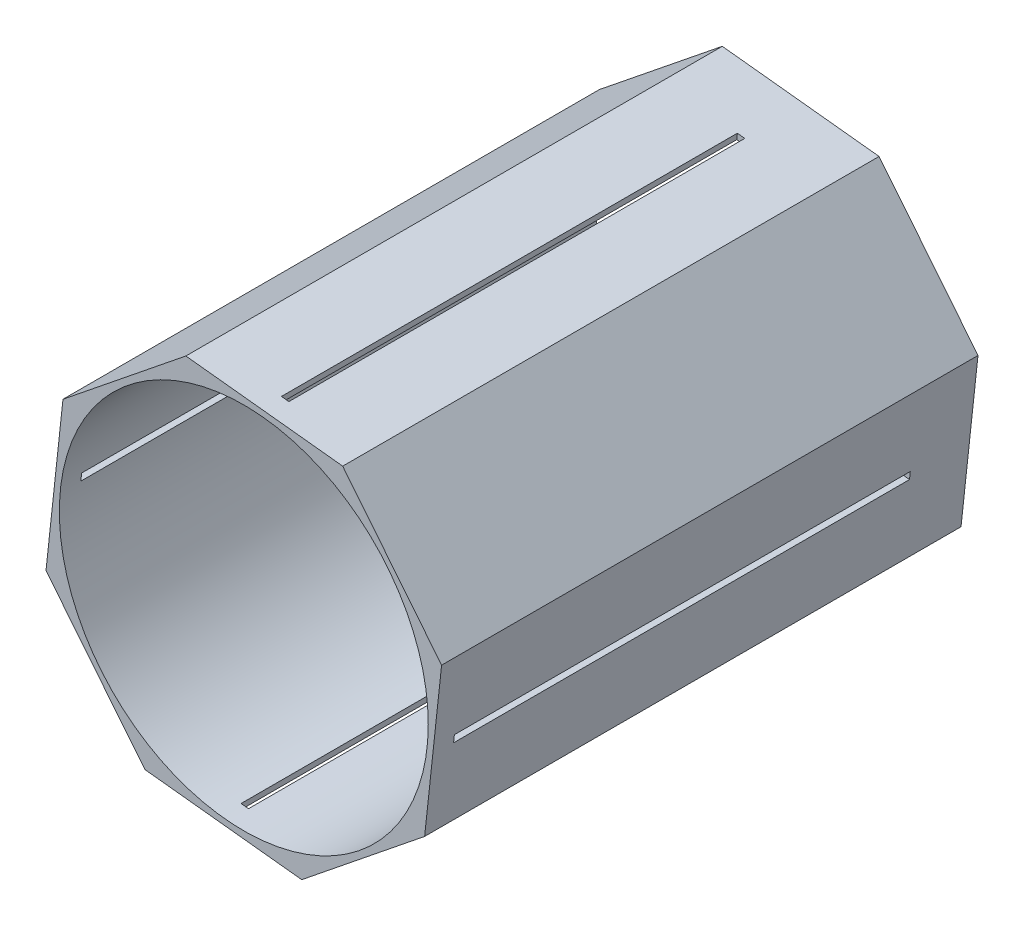
ISO-10303-21;
HEADER;
FILE_DESCRIPTION(('STEP AP214'),'2;1');
FILE_NAME('part.step','',(''),(''),'','','');
FILE_SCHEMA(('AUTOMOTIVE_DESIGN { 1 0 10303 214 1 1 1 1 }'));
ENDSEC;
DATA;
#1=APPLICATION_CONTEXT('core data for automotive mechanical design processes');
#2=APPLICATION_PROTOCOL_DEFINITION('international standard','automotive_design',2000,#1);
#3=PRODUCT_CONTEXT('',#1,'mechanical');
#4=PRODUCT('Part','Part','',(#3));
#5=PRODUCT_RELATED_PRODUCT_CATEGORY('part','',(#4));
#6=PRODUCT_DEFINITION_FORMATION('','',#4);
#7=PRODUCT_DEFINITION_CONTEXT('part definition',#1,'design');
#8=PRODUCT_DEFINITION('design','',#6,#7);
#9=PRODUCT_DEFINITION_SHAPE('','',#8);
#10=(LENGTH_UNIT() NAMED_UNIT(*) SI_UNIT(.MILLI.,.METRE.));
#11=(NAMED_UNIT(*) PLANE_ANGLE_UNIT() SI_UNIT($,.RADIAN.));
#12=(NAMED_UNIT(*) SI_UNIT($,.STERADIAN.) SOLID_ANGLE_UNIT());
#13=UNCERTAINTY_MEASURE_WITH_UNIT(LENGTH_MEASURE(1.E-05),#10,'distance_accuracy_value','');
#14=(GEOMETRIC_REPRESENTATION_CONTEXT(3) GLOBAL_UNCERTAINTY_ASSIGNED_CONTEXT((#13)) GLOBAL_UNIT_ASSIGNED_CONTEXT((#10,
#11,#12)) REPRESENTATION_CONTEXT('',''));
#15=CARTESIAN_POINT('',(0.,0.,0.));
#16=DIRECTION('',(0.,0.,1.));
#17=DIRECTION('',(1.,0.,0.));
#18=AXIS2_PLACEMENT_3D('',#15,#16,#17);
#19=CARTESIAN_POINT('',(0.,0.,228.6));
#20=DIRECTION('',(0.,0.,1.));
#21=DIRECTION('',(1.,0.,0.));
#22=AXIS2_PLACEMENT_3D('',#19,#20,#21);
#23=PLANE('',#22);
#24=DIRECTION('',(-0.626948126265606,0.779061003370112,0.));
#25=VECTOR('',#24,1.);
#26=CARTESIAN_POINT('',(84.2977940013584,24.6908402384421,228.6));
#27=LINE('',#26,#25);
#28=CARTESIAN_POINT('',(84.2977940013584,24.6908402384421,228.6));
#29=VERTEX_POINT('',#28);
#30=CARTESIAN_POINT('',(42.1484812116311,77.0666023432233,228.6));
#31=VERTEX_POINT('',#30);
#32=EDGE_CURVE('E290',#29,#31,#27,.T.);
#33=ORIENTED_EDGE('',*,*,#32,.T.);
#34=DIRECTION('',(-0.994198589975612,0.107560046906393,0.));
#35=VECTOR('',#34,1.);
#36=CARTESIAN_POINT('',(42.1484812116311,77.0666023432233,228.6));
#37=LINE('',#36,#35);
#38=CARTESIAN_POINT('',(-24.6908402384421,84.2977940013584,228.6));
#39=VERTEX_POINT('',#38);
#40=EDGE_CURVE('E293',#31,#39,#37,.T.);
#41=ORIENTED_EDGE('',*,*,#40,.T.);
#42=DIRECTION('',(-0.779061003370113,-0.626948126265606,0.));
#43=VECTOR('',#42,1.);
#44=CARTESIAN_POINT('',(-24.6908402384421,84.2977940013584,228.6));
#45=LINE('',#44,#43);
#46=CARTESIAN_POINT('',(-77.0666023432233,42.1484812116311,228.6));
#47=VERTEX_POINT('',#46);
#48=EDGE_CURVE('E296',#39,#47,#45,.T.);
#49=ORIENTED_EDGE('',*,*,#48,.T.);
#50=DIRECTION('',(-0.107560046906393,-0.994198589975612,0.));
#51=VECTOR('',#50,1.);
#52=CARTESIAN_POINT('',(-77.0666023432233,42.1484812116311,228.6));
#53=LINE('',#52,#51);
#54=CARTESIAN_POINT('',(-84.2977940013584,-24.6908402384421,228.6));
#55=VERTEX_POINT('',#54);
#56=EDGE_CURVE('E298',#47,#55,#53,.T.);
#57=ORIENTED_EDGE('',*,*,#56,.T.);
#58=DIRECTION('',(0.626948126265605,-0.779061003370112,0.));
#59=VECTOR('',#58,1.);
#60=CARTESIAN_POINT('',(-84.2977940013584,-24.6908402384421,228.6));
#61=LINE('',#60,#59);
#62=CARTESIAN_POINT('',(-42.148481211631,-77.0666023432233,228.6));
#63=VERTEX_POINT('',#62);
#64=EDGE_CURVE('E300',#55,#63,#61,.T.);
#65=ORIENTED_EDGE('',*,*,#64,.T.);
#66=DIRECTION('',(0.994198589975612,-0.107560046906393,0.));
#67=VECTOR('',#66,1.);
#68=CARTESIAN_POINT('',(-42.148481211631,-77.0666023432233,228.6));
#69=LINE('',#68,#67);
#70=CARTESIAN_POINT('',(24.6908402384421,-84.2977940013584,228.6));
#71=VERTEX_POINT('',#70);
#72=EDGE_CURVE('E302',#63,#71,#69,.T.);
#73=ORIENTED_EDGE('',*,*,#72,.T.);
#74=DIRECTION('',(0.779061003370113,0.626948126265605,0.));
#75=VECTOR('',#74,1.);
#76=CARTESIAN_POINT('',(24.6908402384421,-84.2977940013584,228.6));
#77=LINE('',#76,#75);
#78=CARTESIAN_POINT('',(77.0666023432233,-42.1484812116311,228.6));
#79=VERTEX_POINT('',#78);
#80=EDGE_CURVE('E304',#71,#79,#77,.T.);
#81=ORIENTED_EDGE('',*,*,#80,.T.);
#82=DIRECTION('',(0.107560046906393,0.994198589975612,0.));
#83=VECTOR('',#82,1.);
#84=CARTESIAN_POINT('',(77.0666023432233,-42.1484812116311,228.6));
#85=LINE('',#84,#83);
#86=EDGE_CURVE('E306',#79,#29,#85,.T.);
#87=ORIENTED_EDGE('',*,*,#86,.T.);
#88=EDGE_LOOP('',(#33,#41,#49,#57,#65,#73,#81,#87));
#89=FACE_BOUND('',#88,.T.);
#90=CARTESIAN_POINT('',(0.,0.,228.6));
#91=DIRECTION('',(0.,0.,1.));
#92=DIRECTION('',(1.,0.,0.));
#93=AXIS2_PLACEMENT_3D('',#90,#91,#92);
#94=CIRCLE('',#93,78.613);
#95=CARTESIAN_POINT('',(78.613,0.,228.6));
#96=VERTEX_POINT('',#95);
#97=EDGE_CURVE('E284',#96,#96,#94,.T.);
#98=ORIENTED_EDGE('',*,*,#97,.F.);
#99=EDGE_LOOP('',(#98));
#100=FACE_BOUND('',#99,.T.);
#101=ADVANCED_FACE('F37',(#89,#100),#23,.T.);
#102=CARTESIAN_POINT('',(0.,0.,0.));
#103=DIRECTION('',(0.,0.,1.));
#104=DIRECTION('',(1.,0.,0.));
#105=AXIS2_PLACEMENT_3D('',#102,#103,#104);
#106=PLANE('',#105);
#107=DIRECTION('',(-0.626948126265606,0.779061003370112,0.));
#108=VECTOR('',#107,1.);
#109=CARTESIAN_POINT('',(84.2977940013584,24.6908402384421,0.));
#110=LINE('',#109,#108);
#111=CARTESIAN_POINT('',(84.2977940013584,24.6908402384421,0.));
#112=VERTEX_POINT('',#111);
#113=CARTESIAN_POINT('',(42.1484812116311,77.0666023432233,0.));
#114=VERTEX_POINT('',#113);
#115=EDGE_CURVE('E287',#112,#114,#110,.T.);
#116=ORIENTED_EDGE('',*,*,#115,.F.);
#117=DIRECTION('',(0.107560046906393,0.994198589975612,0.));
#118=VECTOR('',#117,1.);
#119=CARTESIAN_POINT('',(77.0666023432233,-42.1484812116311,0.));
#120=LINE('',#119,#118);
#121=CARTESIAN_POINT('',(77.0666023432233,-42.1484812116311,0.));
#122=VERTEX_POINT('',#121);
#123=EDGE_CURVE('E294',#122,#112,#120,.T.);
#124=ORIENTED_EDGE('',*,*,#123,.F.);
#125=DIRECTION('',(0.779061003370113,0.626948126265605,0.));
#126=VECTOR('',#125,1.);
#127=CARTESIAN_POINT('',(24.6908402384421,-84.2977940013584,0.));
#128=LINE('',#127,#126);
#129=CARTESIAN_POINT('',(24.6908402384421,-84.2977940013584,0.));
#130=VERTEX_POINT('',#129);
#131=EDGE_CURVE('E321',#130,#122,#128,.T.);
#132=ORIENTED_EDGE('',*,*,#131,.F.);
#133=DIRECTION('',(0.994198589975612,-0.107560046906393,0.));
#134=VECTOR('',#133,1.);
#135=CARTESIAN_POINT('',(-42.148481211631,-77.0666023432233,0.));
#136=LINE('',#135,#134);
#137=CARTESIAN_POINT('',(-42.148481211631,-77.0666023432233,0.));
#138=VERTEX_POINT('',#137);
#139=EDGE_CURVE('E319',#138,#130,#136,.T.);
#140=ORIENTED_EDGE('',*,*,#139,.F.);
#141=DIRECTION('',(0.626948126265605,-0.779061003370112,0.));
#142=VECTOR('',#141,1.);
#143=CARTESIAN_POINT('',(-84.2977940013584,-24.6908402384421,0.));
#144=LINE('',#143,#142);
#145=CARTESIAN_POINT('',(-84.2977940013584,-24.6908402384421,0.));
#146=VERTEX_POINT('',#145);
#147=EDGE_CURVE('E317',#146,#138,#144,.T.);
#148=ORIENTED_EDGE('',*,*,#147,.F.);
#149=DIRECTION('',(-0.107560046906393,-0.994198589975612,0.));
#150=VECTOR('',#149,1.);
#151=CARTESIAN_POINT('',(-77.0666023432233,42.1484812116311,0.));
#152=LINE('',#151,#150);
#153=CARTESIAN_POINT('',(-77.0666023432233,42.1484812116311,0.));
#154=VERTEX_POINT('',#153);
#155=EDGE_CURVE('E315',#154,#146,#152,.T.);
#156=ORIENTED_EDGE('',*,*,#155,.F.);
#157=DIRECTION('',(-0.779061003370113,-0.626948126265606,0.));
#158=VECTOR('',#157,1.);
#159=CARTESIAN_POINT('',(-24.6908402384421,84.2977940013584,0.));
#160=LINE('',#159,#158);
#161=CARTESIAN_POINT('',(-24.6908402384421,84.2977940013584,0.));
#162=VERTEX_POINT('',#161);
#163=EDGE_CURVE('E313',#162,#154,#160,.T.);
#164=ORIENTED_EDGE('',*,*,#163,.F.);
#165=DIRECTION('',(-0.994198589975612,0.107560046906393,0.));
#166=VECTOR('',#165,1.);
#167=CARTESIAN_POINT('',(42.1484812116311,77.0666023432233,0.));
#168=LINE('',#167,#166);
#169=EDGE_CURVE('E311',#114,#162,#168,.T.);
#170=ORIENTED_EDGE('',*,*,#169,.F.);
#171=EDGE_LOOP('',(#116,#124,#132,#140,#148,#156,#164,#170));
#172=FACE_BOUND('',#171,.T.);
#173=CARTESIAN_POINT('',(0.,0.,0.));
#174=DIRECTION('',(0.,0.,1.));
#175=DIRECTION('',(1.,0.,0.));
#176=AXIS2_PLACEMENT_3D('',#173,#174,#175);
#177=CIRCLE('',#176,78.613);
#178=CARTESIAN_POINT('',(78.613,0.,0.));
#179=VERTEX_POINT('',#178);
#180=EDGE_CURVE('E283',#179,#179,#177,.T.);
#181=ORIENTED_EDGE('',*,*,#180,.T.);
#182=EDGE_LOOP('',(#181));
#183=FACE_BOUND('',#182,.T.);
#184=ADVANCED_FACE('F405',(#172,#183),#106,.F.);
#185=CARTESIAN_POINT('',(84.2977940013584,24.6908402384421,228.6));
#186=DIRECTION('',(-0.779061003370113,-0.626948126265606,0.));
#187=DIRECTION('',(0.626948126265606,-0.779061003370112,0.));
#188=AXIS2_PLACEMENT_3D('',#185,#186,#187);
#189=PLANE('',#188);
#190=ORIENTED_EDGE('',*,*,#115,.T.);
#191=DIRECTION('',(0.,0.,-1.));
#192=VECTOR('',#191,1.);
#193=CARTESIAN_POINT('',(42.1484812116311,77.0666023432233,228.6));
#194=LINE('',#193,#192);
#195=EDGE_CURVE('E344',#31,#114,#194,.T.);
#196=ORIENTED_EDGE('',*,*,#195,.F.);
#197=ORIENTED_EDGE('',*,*,#32,.F.);
#198=DIRECTION('',(0.,0.,-1.));
#199=VECTOR('',#198,1.);
#200=CARTESIAN_POINT('',(84.2977940013584,24.6908402384421,228.6));
#201=LINE('',#200,#199);
#202=EDGE_CURVE('E308',#29,#112,#201,.T.);
#203=ORIENTED_EDGE('',*,*,#202,.T.);
#204=EDGE_LOOP('',(#190,#196,#197,#203));
#205=FACE_BOUND('',#204,.T.);
#206=ADVANCED_FACE('F39',(#205),#189,.F.);
#207=CARTESIAN_POINT('',(42.1484812116311,77.0666023432233,228.6));
#208=DIRECTION('',(-0.107560046906393,-0.994198589975612,0.));
#209=DIRECTION('',(0.994198589975612,-0.107560046906393,0.));
#210=AXIS2_PLACEMENT_3D('',#207,#208,#209);
#211=PLANE('',#210);
#212=DIRECTION('',(-0.994198589975612,0.107560046906396,0.));
#213=VECTOR('',#212,1.);
#214=CARTESIAN_POINT('',(7.1505302250082,80.8529497467547,25.4000000000001));
#215=LINE('',#214,#213);
#216=CARTESIAN_POINT('',(10.3071107481808,80.5114465978269,25.4000000000001));
#217=VERTEX_POINT('',#216);
#218=CARTESIAN_POINT('',(7.1505302250082,80.8529497467547,25.4000000000001));
#219=VERTEX_POINT('',#218);
#220=EDGE_CURVE('E249',#217,#219,#215,.T.);
#221=ORIENTED_EDGE('',*,*,#220,.F.);
#222=DIRECTION('',(0.,0.,-1.));
#223=VECTOR('',#222,1.);
#224=CARTESIAN_POINT('',(10.3071107481808,80.5114465978269,25.4000000000001));
#225=LINE('',#224,#223);
#226=CARTESIAN_POINT('',(10.3071107481808,80.5114465978269,219.71));
#227=VERTEX_POINT('',#226);
#228=EDGE_CURVE('E247',#227,#217,#225,.T.);
#229=ORIENTED_EDGE('',*,*,#228,.F.);
#230=DIRECTION('',(0.994198589975612,-0.107560046906393,0.));
#231=VECTOR('',#230,1.);
#232=CARTESIAN_POINT('',(7.15053022500825,80.8529497467547,219.71));
#233=LINE('',#232,#231);
#234=CARTESIAN_POINT('',(7.15053022500825,80.8529497467547,219.71));
#235=VERTEX_POINT('',#234);
#236=EDGE_CURVE('E255',#235,#227,#233,.T.);
#237=ORIENTED_EDGE('',*,*,#236,.F.);
#238=DIRECTION('',(0.,0.,1.));
#239=VECTOR('',#238,1.);
#240=CARTESIAN_POINT('',(7.1505302250082,80.8529497467547,25.4000000000001));
#241=LINE('',#240,#239);
#242=EDGE_CURVE('E252',#219,#235,#241,.T.);
#243=ORIENTED_EDGE('',*,*,#242,.F.);
#244=EDGE_LOOP('',(#221,#229,#237,#243));
#245=FACE_BOUND('',#244,.T.);
#246=ORIENTED_EDGE('',*,*,#169,.T.);
#247=DIRECTION('',(0.,0.,-1.));
#248=VECTOR('',#247,1.);
#249=CARTESIAN_POINT('',(-24.6908402384421,84.2977940013584,228.6));
#250=LINE('',#249,#248);
#251=EDGE_CURVE('E341',#39,#162,#250,.T.);
#252=ORIENTED_EDGE('',*,*,#251,.F.);
#253=ORIENTED_EDGE('',*,*,#40,.F.);
#254=ORIENTED_EDGE('',*,*,#195,.T.);
#255=EDGE_LOOP('',(#246,#252,#253,#254));
#256=FACE_BOUND('',#255,.T.);
#257=ADVANCED_FACE('F413',(#245,#256),#211,.F.);
#258=CARTESIAN_POINT('',(-24.6908402384421,84.2977940013584,228.6));
#259=DIRECTION('',(0.626948126265606,-0.779061003370112,0.));
#260=DIRECTION('',(0.779061003370112,0.626948126265606,0.));
#261=AXIS2_PLACEMENT_3D('',#258,#259,#260);
#262=PLANE('',#261);
#263=ORIENTED_EDGE('',*,*,#163,.T.);
#264=DIRECTION('',(0.,0.,-1.));
#265=VECTOR('',#264,1.);
#266=CARTESIAN_POINT('',(-77.0666023432233,42.1484812116311,228.6));
#267=LINE('',#266,#265);
#268=EDGE_CURVE('E338',#47,#154,#267,.T.);
#269=ORIENTED_EDGE('',*,*,#268,.F.);
#270=ORIENTED_EDGE('',*,*,#48,.F.);
#271=ORIENTED_EDGE('',*,*,#251,.T.);
#272=EDGE_LOOP('',(#263,#269,#270,#271));
#273=FACE_BOUND('',#272,.T.);
#274=ADVANCED_FACE('F436',(#273),#262,.F.);
#275=CARTESIAN_POINT('',(-77.0666023432233,42.1484812116311,228.6));
#276=DIRECTION('',(0.994198589975612,-0.107560046906393,0.));
#277=DIRECTION('',(0.107560046906393,0.994198589975612,0.));
#278=AXIS2_PLACEMENT_3D('',#275,#276,#277);
#279=PLANE('',#278);
#280=DIRECTION('',(0.,0.,-1.));
#281=VECTOR('',#280,1.);
#282=CARTESIAN_POINT('',(-80.5114465978269,10.3071107481807,25.4));
#283=LINE('',#282,#281);
#284=CARTESIAN_POINT('',(-80.5114465978269,10.3071107481808,219.71));
#285=VERTEX_POINT('',#284);
#286=CARTESIAN_POINT('',(-80.5114465978269,10.3071107481807,25.4));
#287=VERTEX_POINT('',#286);
#288=EDGE_CURVE('E215',#285,#287,#283,.T.);
#289=ORIENTED_EDGE('',*,*,#288,.F.);
#290=DIRECTION('',(0.107560046906395,0.994198589975612,0.));
#291=VECTOR('',#290,1.);
#292=CARTESIAN_POINT('',(-80.8529497467547,7.15053022500818,219.71));
#293=LINE('',#292,#291);
#294=CARTESIAN_POINT('',(-80.8529497467547,7.15053022500818,219.71));
#295=VERTEX_POINT('',#294);
#296=EDGE_CURVE('E54',#295,#285,#293,.T.);
#297=ORIENTED_EDGE('',*,*,#296,.F.);
#298=DIRECTION('',(0.,0.,1.));
#299=VECTOR('',#298,1.);
#300=CARTESIAN_POINT('',(-80.8529497467547,7.15053022500818,25.4));
#301=LINE('',#300,#299);
#302=CARTESIAN_POINT('',(-80.8529497467547,7.15053022500818,25.4));
#303=VERTEX_POINT('',#302);
#304=EDGE_CURVE('E223',#303,#295,#301,.T.);
#305=ORIENTED_EDGE('',*,*,#304,.F.);
#306=DIRECTION('',(-0.107560046906396,-0.994198589975612,0.));
#307=VECTOR('',#306,1.);
#308=CARTESIAN_POINT('',(-80.8529497467547,7.15053022500818,25.4));
#309=LINE('',#308,#307);
#310=EDGE_CURVE('E206',#287,#303,#309,.T.);
#311=ORIENTED_EDGE('',*,*,#310,.F.);
#312=EDGE_LOOP('',(#289,#297,#305,#311));
#313=FACE_BOUND('',#312,.T.);
#314=ORIENTED_EDGE('',*,*,#155,.T.);
#315=DIRECTION('',(0.,0.,-1.));
#316=VECTOR('',#315,1.);
#317=CARTESIAN_POINT('',(-84.2977940013584,-24.6908402384421,228.6));
#318=LINE('',#317,#316);
#319=EDGE_CURVE('E335',#55,#146,#318,.T.);
#320=ORIENTED_EDGE('',*,*,#319,.F.);
#321=ORIENTED_EDGE('',*,*,#56,.F.);
#322=ORIENTED_EDGE('',*,*,#268,.T.);
#323=EDGE_LOOP('',(#314,#320,#321,#322));
#324=FACE_BOUND('',#323,.T.);
#325=ADVANCED_FACE('F220',(#313,#324),#279,.F.);
#326=CARTESIAN_POINT('',(-84.2977940013584,-24.6908402384421,228.6));
#327=DIRECTION('',(0.779061003370112,0.626948126265606,0.));
#328=DIRECTION('',(-0.626948126265606,0.779061003370112,0.));
#329=AXIS2_PLACEMENT_3D('',#326,#327,#328);
#330=PLANE('',#329);
#331=ORIENTED_EDGE('',*,*,#147,.T.);
#332=DIRECTION('',(0.,0.,-1.));
#333=VECTOR('',#332,1.);
#334=CARTESIAN_POINT('',(-42.148481211631,-77.0666023432233,228.6));
#335=LINE('',#334,#333);
#336=EDGE_CURVE('E332',#63,#138,#335,.T.);
#337=ORIENTED_EDGE('',*,*,#336,.F.);
#338=ORIENTED_EDGE('',*,*,#64,.F.);
#339=ORIENTED_EDGE('',*,*,#319,.T.);
#340=EDGE_LOOP('',(#331,#337,#338,#339));
#341=FACE_BOUND('',#340,.T.);
#342=ADVANCED_FACE('F429',(#341),#330,.F.);
#343=CARTESIAN_POINT('',(-42.148481211631,-77.0666023432233,228.6));
#344=DIRECTION('',(0.107560046906393,0.994198589975612,0.));
#345=DIRECTION('',(-0.994198589975612,0.107560046906393,0.));
#346=AXIS2_PLACEMENT_3D('',#343,#344,#345);
#347=PLANE('',#346);
#348=DIRECTION('',(0.994198589975612,-0.107560046906393,0.));
#349=VECTOR('',#348,1.);
#350=CARTESIAN_POINT('',(-42.148481211631,-77.0666023432233,219.71));
#351=LINE('',#350,#349);
#352=CARTESIAN_POINT('',(-10.3071107481809,-80.5114465978269,219.71));
#353=VERTEX_POINT('',#352);
#354=CARTESIAN_POINT('',(-7.15053022500835,-80.8529497467547,219.71));
#355=VERTEX_POINT('',#354);
#356=EDGE_CURVE('E277',#353,#355,#351,.T.);
#357=ORIENTED_EDGE('',*,*,#356,.T.);
#358=DIRECTION('',(0.,0.,-1.));
#359=VECTOR('',#358,1.);
#360=CARTESIAN_POINT('',(-7.15053022500835,-80.8529497467547,228.6));
#361=LINE('',#360,#359);
#362=CARTESIAN_POINT('',(-7.15053022500837,-80.8529497467547,25.4000000000001));
#363=VERTEX_POINT('',#362);
#364=EDGE_CURVE('E280',#355,#363,#361,.T.);
#365=ORIENTED_EDGE('',*,*,#364,.T.);
#366=DIRECTION('',(-0.994198589975612,0.107560046906393,0.));
#367=VECTOR('',#366,1.);
#368=CARTESIAN_POINT('',(-42.148481211631,-77.0666023432233,25.4000000000001));
#369=LINE('',#368,#367);
#370=CARTESIAN_POINT('',(-10.3071107481809,-80.5114465978269,25.4000000000001));
#371=VERTEX_POINT('',#370);
#372=EDGE_CURVE('E271',#363,#371,#369,.T.);
#373=ORIENTED_EDGE('',*,*,#372,.T.);
#374=DIRECTION('',(0.,0.,1.));
#375=VECTOR('',#374,1.);
#376=CARTESIAN_POINT('',(-10.3071107481809,-80.5114465978269,228.6));
#377=LINE('',#376,#375);
#378=EDGE_CURVE('E274',#371,#353,#377,.T.);
#379=ORIENTED_EDGE('',*,*,#378,.T.);
#380=EDGE_LOOP('',(#357,#365,#373,#379));
#381=FACE_BOUND('',#380,.T.);
#382=ORIENTED_EDGE('',*,*,#139,.T.);
#383=DIRECTION('',(0.,0.,-1.));
#384=VECTOR('',#383,1.);
#385=CARTESIAN_POINT('',(24.6908402384421,-84.2977940013584,228.6));
#386=LINE('',#385,#384);
#387=EDGE_CURVE('E329',#71,#130,#386,.T.);
#388=ORIENTED_EDGE('',*,*,#387,.F.);
#389=ORIENTED_EDGE('',*,*,#72,.F.);
#390=ORIENTED_EDGE('',*,*,#336,.T.);
#391=EDGE_LOOP('',(#382,#388,#389,#390));
#392=FACE_BOUND('',#391,.T.);
#393=ADVANCED_FACE('F425',(#381,#392),#347,.F.);
#394=CARTESIAN_POINT('',(24.6908402384421,-84.2977940013584,228.6));
#395=DIRECTION('',(-0.626948126265605,0.779061003370113,0.));
#396=DIRECTION('',(-0.779061003370113,-0.626948126265605,0.));
#397=AXIS2_PLACEMENT_3D('',#394,#395,#396);
#398=PLANE('',#397);
#399=ORIENTED_EDGE('',*,*,#131,.T.);
#400=DIRECTION('',(0.,0.,-1.));
#401=VECTOR('',#400,1.);
#402=CARTESIAN_POINT('',(77.0666023432233,-42.1484812116311,228.6));
#403=LINE('',#402,#401);
#404=EDGE_CURVE('E326',#79,#122,#403,.T.);
#405=ORIENTED_EDGE('',*,*,#404,.F.);
#406=ORIENTED_EDGE('',*,*,#80,.F.);
#407=ORIENTED_EDGE('',*,*,#387,.T.);
#408=EDGE_LOOP('',(#399,#405,#406,#407));
#409=FACE_BOUND('',#408,.T.);
#410=ADVANCED_FACE('F421',(#409),#398,.F.);
#411=CARTESIAN_POINT('',(77.0666023432233,-42.1484812116311,228.6));
#412=DIRECTION('',(-0.994198589975612,0.107560046906393,0.));
#413=DIRECTION('',(-0.107560046906393,-0.994198589975612,0.));
#414=AXIS2_PLACEMENT_3D('',#411,#412,#413);
#415=PLANE('',#414);
#416=DIRECTION('',(0.,0.,1.));
#417=VECTOR('',#416,1.);
#418=CARTESIAN_POINT('',(80.5114465978269,-10.307110748181,228.6));
#419=LINE('',#418,#417);
#420=CARTESIAN_POINT('',(80.5114465978269,-10.307110748181,25.4));
#421=VERTEX_POINT('',#420);
#422=CARTESIAN_POINT('',(80.5114465978269,-10.307110748181,219.71));
#423=VERTEX_POINT('',#422);
#424=EDGE_CURVE('E241',#421,#423,#419,.T.);
#425=ORIENTED_EDGE('',*,*,#424,.T.);
#426=DIRECTION('',(0.107560046906393,0.994198589975612,0.));
#427=VECTOR('',#426,1.);
#428=CARTESIAN_POINT('',(77.0666023432233,-42.1484812116311,219.71));
#429=LINE('',#428,#427);
#430=CARTESIAN_POINT('',(80.8529497467547,-7.15053022500836,219.71));
#431=VERTEX_POINT('',#430);
#432=EDGE_CURVE('E244',#423,#431,#429,.T.);
#433=ORIENTED_EDGE('',*,*,#432,.T.);
#434=DIRECTION('',(0.,0.,-1.));
#435=VECTOR('',#434,1.);
#436=CARTESIAN_POINT('',(80.8529497467547,-7.15053022500836,228.6));
#437=LINE('',#436,#435);
#438=CARTESIAN_POINT('',(80.8529497467547,-7.15053022500841,25.4));
#439=VERTEX_POINT('',#438);
#440=EDGE_CURVE('E235',#431,#439,#437,.T.);
#441=ORIENTED_EDGE('',*,*,#440,.T.);
#442=DIRECTION('',(-0.107560046906393,-0.994198589975612,0.));
#443=VECTOR('',#442,1.);
#444=CARTESIAN_POINT('',(77.0666023432233,-42.1484812116311,25.4));
#445=LINE('',#444,#443);
#446=EDGE_CURVE('E238',#439,#421,#445,.T.);
#447=ORIENTED_EDGE('',*,*,#446,.T.);
#448=EDGE_LOOP('',(#425,#433,#441,#447));
#449=FACE_BOUND('',#448,.T.);
#450=ORIENTED_EDGE('',*,*,#123,.T.);
#451=ORIENTED_EDGE('',*,*,#202,.F.);
#452=ORIENTED_EDGE('',*,*,#86,.F.);
#453=ORIENTED_EDGE('',*,*,#404,.T.);
#454=EDGE_LOOP('',(#450,#451,#452,#453));
#455=FACE_BOUND('',#454,.T.);
#456=ADVANCED_FACE('F388',(#449,#455),#415,.F.);
#457=CARTESIAN_POINT('',(0.,0.,228.6));
#458=DIRECTION('',(0.,0.,-1.));
#459=DIRECTION('',(-1.,0.,0.));
#460=AXIS2_PLACEMENT_3D('',#457,#458,#459);
#461=CYLINDRICAL_SURFACE('',#460,78.613);
#462=CARTESIAN_POINT('',(0.,0.,219.71));
#463=DIRECTION('',(0.,0.,1.));
#464=DIRECTION('',(1.,0.,0.));
#465=AXIS2_PLACEMENT_3D('',#462,#463,#464);
#466=CIRCLE('',#465,78.613);
#467=CARTESIAN_POINT('',(77.9702446671933,-10.0321839864519,219.71));
#468=VERTEX_POINT('',#467);
#469=CARTESIAN_POINT('',(78.3117478161211,-6.87560346327932,219.71));
#470=VERTEX_POINT('',#469);
#471=EDGE_CURVE('E11',#468,#470,#466,.T.);
#472=ORIENTED_EDGE('',*,*,#471,.F.);
#473=DIRECTION('',(0.,0.,-1.));
#474=VECTOR('',#473,1.);
#475=CARTESIAN_POINT('',(77.9702446671933,-10.0321839864519,228.6));
#476=LINE('',#475,#474);
#477=CARTESIAN_POINT('',(77.9702446671933,-10.0321839864519,25.4));
#478=VERTEX_POINT('',#477);
#479=EDGE_CURVE('E41',#478,#468,#476,.F.);
#480=ORIENTED_EDGE('',*,*,#479,.F.);
#481=CARTESIAN_POINT('',(0.,0.,25.4));
#482=DIRECTION('',(0.,0.,-1.));
#483=DIRECTION('',(-1.,0.,0.));
#484=AXIS2_PLACEMENT_3D('',#481,#482,#483);
#485=CIRCLE('',#484,78.613);
#486=CARTESIAN_POINT('',(78.311747816121,-6.87560346327936,25.4));
#487=VERTEX_POINT('',#486);
#488=EDGE_CURVE('E367',#487,#478,#485,.T.);
#489=ORIENTED_EDGE('',*,*,#488,.F.);
#490=DIRECTION('',(0.,0.,-1.));
#491=VECTOR('',#490,1.);
#492=CARTESIAN_POINT('',(78.3117478161211,-6.87560346327932,228.6));
#493=LINE('',#492,#491);
#494=EDGE_CURVE('E368',#470,#487,#493,.T.);
#495=ORIENTED_EDGE('',*,*,#494,.F.);
#496=EDGE_LOOP('',(#472,#480,#489,#495));
#497=FACE_BOUND('',#496,.T.);
#498=CARTESIAN_POINT('',(-77.9702446671933,10.0321839864518,219.71));
#499=VERTEX_POINT('',#498);
#500=CARTESIAN_POINT('',(-78.3117478161211,6.87560346327914,219.71));
#501=VERTEX_POINT('',#500);
#502=EDGE_CURVE('E47',#499,#501,#466,.T.);
#503=ORIENTED_EDGE('',*,*,#502,.F.);
#504=DIRECTION('',(0.,0.,-1.));
#505=VECTOR('',#504,1.);
#506=CARTESIAN_POINT('',(-77.9702446671933,10.0321839864518,228.6));
#507=LINE('',#506,#505);
#508=CARTESIAN_POINT('',(-77.9702446671933,10.0321839864518,25.4));
#509=VERTEX_POINT('',#508);
#510=EDGE_CURVE('E363',#509,#499,#507,.F.);
#511=ORIENTED_EDGE('',*,*,#510,.F.);
#512=CARTESIAN_POINT('',(-78.3117478161211,6.87560346327914,25.4));
#513=VERTEX_POINT('',#512);
#514=EDGE_CURVE('E209',#513,#509,#485,.T.);
#515=ORIENTED_EDGE('',*,*,#514,.F.);
#516=DIRECTION('',(0.,0.,-1.));
#517=VECTOR('',#516,1.);
#518=CARTESIAN_POINT('',(-78.3117478161211,6.87560346327914,228.6));
#519=LINE('',#518,#517);
#520=EDGE_CURVE('E366',#501,#513,#519,.T.);
#521=ORIENTED_EDGE('',*,*,#520,.F.);
#522=EDGE_LOOP('',(#503,#511,#515,#521));
#523=FACE_BOUND('',#522,.T.);
#524=DIRECTION('',(0.,0.,-1.));
#525=VECTOR('',#524,1.);
#526=CARTESIAN_POINT('',(10.0321839864518,77.9702446671933,228.6));
#527=LINE('',#526,#525);
#528=CARTESIAN_POINT('',(10.0321839864517,77.9702446671933,25.4000000000001));
#529=VERTEX_POINT('',#528);
#530=CARTESIAN_POINT('',(10.0321839864517,77.9702446671933,219.71));
#531=VERTEX_POINT('',#530);
#532=EDGE_CURVE('E361',#529,#531,#527,.F.);
#533=ORIENTED_EDGE('',*,*,#532,.F.);
#534=CARTESIAN_POINT('',(0.,0.,25.4000000000001));
#535=DIRECTION('',(0.,0.,-1.));
#536=DIRECTION('',(-1.,0.,0.));
#537=AXIS2_PLACEMENT_3D('',#534,#535,#536);
#538=CIRCLE('',#537,78.613);
#539=CARTESIAN_POINT('',(6.87560346327916,78.3117478161211,25.4000000000001));
#540=VERTEX_POINT('',#539);
#541=EDGE_CURVE('E350',#540,#529,#538,.T.);
#542=ORIENTED_EDGE('',*,*,#541,.F.);
#543=DIRECTION('',(0.,0.,-1.));
#544=VECTOR('',#543,1.);
#545=CARTESIAN_POINT('',(6.87560346327921,78.3117478161211,228.6));
#546=LINE('',#545,#544);
#547=CARTESIAN_POINT('',(6.87560346327921,78.311747816121,219.71));
#548=VERTEX_POINT('',#547);
#549=EDGE_CURVE('E358',#548,#540,#546,.T.);
#550=ORIENTED_EDGE('',*,*,#549,.F.);
#551=CARTESIAN_POINT('',(0.,0.,219.71));
#552=DIRECTION('',(0.,0.,1.));
#553=DIRECTION('',(1.,0.,0.));
#554=AXIS2_PLACEMENT_3D('',#551,#552,#553);
#555=CIRCLE('',#554,78.613);
#556=EDGE_CURVE('E355',#531,#548,#555,.T.);
#557=ORIENTED_EDGE('',*,*,#556,.F.);
#558=EDGE_LOOP('',(#533,#542,#550,#557));
#559=FACE_BOUND('',#558,.T.);
#560=DIRECTION('',(0.,0.,-1.));
#561=VECTOR('',#560,1.);
#562=CARTESIAN_POINT('',(-6.87560346327931,-78.3117478161211,228.6));
#563=LINE('',#562,#561);
#564=CARTESIAN_POINT('',(-6.87560346327931,-78.3117478161211,219.71));
#565=VERTEX_POINT('',#564);
#566=CARTESIAN_POINT('',(-6.87560346327933,-78.3117478161211,25.4000000000001));
#567=VERTEX_POINT('',#566);
#568=EDGE_CURVE('E354',#565,#567,#563,.T.);
#569=ORIENTED_EDGE('',*,*,#568,.F.);
#570=CARTESIAN_POINT('',(-10.0321839864519,-77.9702446671933,219.71));
#571=VERTEX_POINT('',#570);
#572=EDGE_CURVE('E352',#571,#565,#555,.T.);
#573=ORIENTED_EDGE('',*,*,#572,.F.);
#574=DIRECTION('',(0.,0.,-1.));
#575=VECTOR('',#574,1.);
#576=CARTESIAN_POINT('',(-10.0321839864518,-77.9702446671933,228.6));
#577=LINE('',#576,#575);
#578=CARTESIAN_POINT('',(-10.0321839864519,-77.9702446671933,25.4000000000001));
#579=VERTEX_POINT('',#578);
#580=EDGE_CURVE('E349',#579,#571,#577,.F.);
#581=ORIENTED_EDGE('',*,*,#580,.F.);
#582=EDGE_CURVE('E347',#567,#579,#538,.T.);
#583=ORIENTED_EDGE('',*,*,#582,.F.);
#584=EDGE_LOOP('',(#569,#573,#581,#583));
#585=FACE_BOUND('',#584,.T.);
#586=ORIENTED_EDGE('',*,*,#97,.T.);
#587=EDGE_LOOP('',(#586));
#588=FACE_BOUND('',#587,.T.);
#589=ORIENTED_EDGE('',*,*,#180,.F.);
#590=EDGE_LOOP('',(#589));
#591=FACE_BOUND('',#590,.T.);
#592=ADVANCED_FACE('F384',(#497,#523,#559,#585,#588,#591),#461,.F.);
#593=CARTESIAN_POINT('',(-14.705671306371,-121.16820373629,25.4000000000001));
#594=DIRECTION('',(0.,0.,-1.));
#595=DIRECTION('',(-1.,0.,0.));
#596=AXIS2_PLACEMENT_3D('',#593,#594,#595);
#597=PLANE('',#596);
#598=DIRECTION('',(0.107560046906394,0.994198589975612,0.));
#599=VECTOR('',#598,1.);
#600=CARTESIAN_POINT('',(-11.5490907831984,-121.509706885217,25.4000000000001));
#601=LINE('',#600,#599);
#602=EDGE_CURVE('E268',#363,#567,#601,.T.);
#603=ORIENTED_EDGE('',*,*,#602,.T.);
#604=ORIENTED_EDGE('',*,*,#582,.T.);
#605=DIRECTION('',(0.107560046906394,0.994198589975612,0.));
#606=VECTOR('',#605,1.);
#607=CARTESIAN_POINT('',(-14.705671306371,-121.16820373629,25.4000000000001));
#608=LINE('',#607,#606);
#609=EDGE_CURVE('E265',#371,#579,#608,.T.);
#610=ORIENTED_EDGE('',*,*,#609,.F.);
#611=ORIENTED_EDGE('',*,*,#372,.F.);
#612=EDGE_LOOP('',(#603,#604,#610,#611));
#613=FACE_BOUND('',#612,.T.);
#614=ADVANCED_FACE('F387',(#613),#597,.F.);
#615=CARTESIAN_POINT('',(-14.705671306371,-121.16820373629,25.4000000000001));
#616=DIRECTION('',(-0.994198589975612,0.107560046906394,0.));
#617=DIRECTION('',(-0.107560046906394,-0.994198589975612,0.));
#618=AXIS2_PLACEMENT_3D('',#615,#616,#617);
#619=PLANE('',#618);
#620=ORIENTED_EDGE('',*,*,#609,.T.);
#621=ORIENTED_EDGE('',*,*,#580,.T.);
#622=DIRECTION('',(0.107560046906394,0.994198589975612,0.));
#623=VECTOR('',#622,1.);
#624=CARTESIAN_POINT('',(-14.705671306371,-121.16820373629,219.71));
#625=LINE('',#624,#623);
#626=EDGE_CURVE('E262',#353,#571,#625,.T.);
#627=ORIENTED_EDGE('',*,*,#626,.F.);
#628=ORIENTED_EDGE('',*,*,#378,.F.);
#629=EDGE_LOOP('',(#620,#621,#627,#628));
#630=FACE_BOUND('',#629,.T.);
#631=ADVANCED_FACE('F486',(#630),#619,.F.);
#632=CARTESIAN_POINT('',(-14.705671306371,-121.16820373629,219.71));
#633=DIRECTION('',(0.,0.,1.));
#634=DIRECTION('',(1.,0.,0.));
#635=AXIS2_PLACEMENT_3D('',#632,#633,#634);
#636=PLANE('',#635);
#637=ORIENTED_EDGE('',*,*,#626,.T.);
#638=ORIENTED_EDGE('',*,*,#572,.T.);
#639=DIRECTION('',(0.107560046906394,0.994198589975612,0.));
#640=VECTOR('',#639,1.);
#641=CARTESIAN_POINT('',(-11.5490907831984,-121.509706885217,219.71));
#642=LINE('',#641,#640);
#643=EDGE_CURVE('E261',#355,#565,#642,.T.);
#644=ORIENTED_EDGE('',*,*,#643,.F.);
#645=ORIENTED_EDGE('',*,*,#356,.F.);
#646=EDGE_LOOP('',(#637,#638,#644,#645));
#647=FACE_BOUND('',#646,.T.);
#648=ADVANCED_FACE('F494',(#647),#636,.F.);
#649=CARTESIAN_POINT('',(-11.5490907831984,-121.509706885217,25.4000000000001));
#650=DIRECTION('',(0.994198589975612,-0.107560046906394,0.));
#651=DIRECTION('',(0.107560046906394,0.994198589975612,0.));
#652=AXIS2_PLACEMENT_3D('',#649,#650,#651);
#653=PLANE('',#652);
#654=ORIENTED_EDGE('',*,*,#643,.T.);
#655=ORIENTED_EDGE('',*,*,#568,.T.);
#656=ORIENTED_EDGE('',*,*,#602,.F.);
#657=ORIENTED_EDGE('',*,*,#364,.F.);
#658=EDGE_LOOP('',(#654,#655,#656,#657));
#659=FACE_BOUND('',#658,.T.);
#660=ADVANCED_FACE('F492',(#659),#653,.F.);
#661=ORIENTED_EDGE('',*,*,#556,.T.);
#662=EDGE_CURVE('E263',#548,#235,#625,.T.);
#663=ORIENTED_EDGE('',*,*,#662,.T.);
#664=ORIENTED_EDGE('',*,*,#236,.T.);
#665=EDGE_CURVE('E259',#531,#227,#642,.T.);
#666=ORIENTED_EDGE('',*,*,#665,.F.);
#667=EDGE_LOOP('',(#661,#663,#664,#666));
#668=FACE_BOUND('',#667,.T.);
#669=ADVANCED_FACE('F479',(#668),#636,.F.);
#670=ORIENTED_EDGE('',*,*,#549,.T.);
#671=EDGE_CURVE('E266',#540,#219,#608,.T.);
#672=ORIENTED_EDGE('',*,*,#671,.T.);
#673=ORIENTED_EDGE('',*,*,#242,.T.);
#674=ORIENTED_EDGE('',*,*,#662,.F.);
#675=EDGE_LOOP('',(#670,#672,#673,#674));
#676=FACE_BOUND('',#675,.T.);
#677=ADVANCED_FACE('F483',(#676),#619,.F.);
#678=ORIENTED_EDGE('',*,*,#541,.T.);
#679=EDGE_CURVE('E258',#529,#217,#601,.T.);
#680=ORIENTED_EDGE('',*,*,#679,.T.);
#681=ORIENTED_EDGE('',*,*,#220,.T.);
#682=ORIENTED_EDGE('',*,*,#671,.F.);
#683=EDGE_LOOP('',(#678,#680,#681,#682));
#684=FACE_BOUND('',#683,.T.);
#685=ADVANCED_FACE('F473',(#684),#597,.F.);
#686=ORIENTED_EDGE('',*,*,#532,.T.);
#687=ORIENTED_EDGE('',*,*,#665,.T.);
#688=ORIENTED_EDGE('',*,*,#228,.T.);
#689=ORIENTED_EDGE('',*,*,#679,.F.);
#690=EDGE_LOOP('',(#686,#687,#688,#689));
#691=FACE_BOUND('',#690,.T.);
#692=ADVANCED_FACE('F476',(#691),#653,.F.);
#693=CARTESIAN_POINT('',(121.509706885217,-11.5490907831985,25.4));
#694=DIRECTION('',(0.107560046906394,0.994198589975612,0.));
#695=DIRECTION('',(-0.994198589975612,0.107560046906394,0.));
#696=AXIS2_PLACEMENT_3D('',#693,#694,#695);
#697=PLANE('',#696);
#698=ORIENTED_EDGE('',*,*,#510,.T.);
#699=DIRECTION('',(-0.994198589975612,0.107560046906394,0.));
#700=VECTOR('',#699,1.);
#701=CARTESIAN_POINT('',(121.509706885217,-11.5490907831984,219.71));
#702=LINE('',#701,#700);
#703=EDGE_CURVE('E217',#499,#285,#702,.T.);
#704=ORIENTED_EDGE('',*,*,#703,.T.);
#705=ORIENTED_EDGE('',*,*,#288,.T.);
#706=DIRECTION('',(-0.994198589975612,0.107560046906394,0.));
#707=VECTOR('',#706,1.);
#708=CARTESIAN_POINT('',(121.509706885217,-11.5490907831985,25.4));
#709=LINE('',#708,#707);
#710=EDGE_CURVE('E201',#509,#287,#709,.T.);
#711=ORIENTED_EDGE('',*,*,#710,.F.);
#712=EDGE_LOOP('',(#698,#704,#705,#711));
#713=FACE_BOUND('',#712,.T.);
#714=ADVANCED_FACE('F216',(#713),#697,.F.);
#715=CARTESIAN_POINT('',(121.16820373629,-14.705671306371,25.4));
#716=DIRECTION('',(0.,0.,-1.));
#717=DIRECTION('',(-1.,0.,0.));
#718=AXIS2_PLACEMENT_3D('',#715,#716,#717);
#719=PLANE('',#718);
#720=ORIENTED_EDGE('',*,*,#514,.T.);
#721=ORIENTED_EDGE('',*,*,#710,.T.);
#722=ORIENTED_EDGE('',*,*,#310,.T.);
#723=DIRECTION('',(-0.994198589975612,0.107560046906394,0.));
#724=VECTOR('',#723,1.);
#725=CARTESIAN_POINT('',(121.16820373629,-14.705671306371,25.4));
#726=LINE('',#725,#724);
#727=EDGE_CURVE('E232',#513,#303,#726,.T.);
#728=ORIENTED_EDGE('',*,*,#727,.F.);
#729=EDGE_LOOP('',(#720,#721,#722,#728));
#730=FACE_BOUND('',#729,.T.);
#731=ADVANCED_FACE('F203',(#730),#719,.F.);
#732=CARTESIAN_POINT('',(121.16820373629,-14.705671306371,25.4));
#733=DIRECTION('',(-0.107560046906394,-0.994198589975612,0.));
#734=DIRECTION('',(0.994198589975612,-0.107560046906394,0.));
#735=AXIS2_PLACEMENT_3D('',#732,#733,#734);
#736=PLANE('',#735);
#737=ORIENTED_EDGE('',*,*,#520,.T.);
#738=ORIENTED_EDGE('',*,*,#727,.T.);
#739=ORIENTED_EDGE('',*,*,#304,.T.);
#740=DIRECTION('',(-0.994198589975612,0.107560046906394,0.));
#741=VECTOR('',#740,1.);
#742=CARTESIAN_POINT('',(121.16820373629,-14.705671306371,219.71));
#743=LINE('',#742,#741);
#744=EDGE_CURVE('E228',#501,#295,#743,.T.);
#745=ORIENTED_EDGE('',*,*,#744,.F.);
#746=EDGE_LOOP('',(#737,#738,#739,#745));
#747=FACE_BOUND('',#746,.T.);
#748=ADVANCED_FACE('F525',(#747),#736,.F.);
#749=CARTESIAN_POINT('',(121.16820373629,-14.705671306371,219.71));
#750=DIRECTION('',(0.,0.,1.));
#751=DIRECTION('',(1.,0.,0.));
#752=AXIS2_PLACEMENT_3D('',#749,#750,#751);
#753=PLANE('',#752);
#754=ORIENTED_EDGE('',*,*,#502,.T.);
#755=ORIENTED_EDGE('',*,*,#744,.T.);
#756=ORIENTED_EDGE('',*,*,#296,.T.);
#757=ORIENTED_EDGE('',*,*,#703,.F.);
#758=EDGE_LOOP('',(#754,#755,#756,#757));
#759=FACE_BOUND('',#758,.T.);
#760=ADVANCED_FACE('F540',(#759),#753,.F.);
#761=EDGE_CURVE('E230',#423,#468,#743,.T.);
#762=ORIENTED_EDGE('',*,*,#761,.T.);
#763=ORIENTED_EDGE('',*,*,#471,.T.);
#764=EDGE_CURVE('E212',#431,#470,#702,.T.);
#765=ORIENTED_EDGE('',*,*,#764,.F.);
#766=ORIENTED_EDGE('',*,*,#432,.F.);
#767=EDGE_LOOP('',(#762,#763,#765,#766));
#768=FACE_BOUND('',#767,.T.);
#769=ADVANCED_FACE('F382',(#768),#753,.F.);
#770=EDGE_CURVE('E231',#421,#478,#726,.T.);
#771=ORIENTED_EDGE('',*,*,#770,.T.);
#772=ORIENTED_EDGE('',*,*,#479,.T.);
#773=ORIENTED_EDGE('',*,*,#761,.F.);
#774=ORIENTED_EDGE('',*,*,#424,.F.);
#775=EDGE_LOOP('',(#771,#772,#773,#774));
#776=FACE_BOUND('',#775,.T.);
#777=ADVANCED_FACE('F378',(#776),#736,.F.);
#778=EDGE_CURVE('E62',#439,#487,#709,.T.);
#779=ORIENTED_EDGE('',*,*,#778,.T.);
#780=ORIENTED_EDGE('',*,*,#488,.T.);
#781=ORIENTED_EDGE('',*,*,#770,.F.);
#782=ORIENTED_EDGE('',*,*,#446,.F.);
#783=EDGE_LOOP('',(#779,#780,#781,#782));
#784=FACE_BOUND('',#783,.T.);
#785=ADVANCED_FACE('F527',(#784),#719,.F.);
#786=ORIENTED_EDGE('',*,*,#764,.T.);
#787=ORIENTED_EDGE('',*,*,#494,.T.);
#788=ORIENTED_EDGE('',*,*,#778,.F.);
#789=ORIENTED_EDGE('',*,*,#440,.F.);
#790=EDGE_LOOP('',(#786,#787,#788,#789));
#791=FACE_BOUND('',#790,.T.);
#792=ADVANCED_FACE('F521',(#791),#697,.F.);
#793=CLOSED_SHELL('',(#101,#184,#206,#257,#274,#325,#342,#393,#410,#456,#592,#614,#631,#648,
#660,#669,#677,#685,#692,#714,#731,#748,#760,#769,#777,#785,#792));
#794=MANIFOLD_SOLID_BREP('B2',#793);
#795=ADVANCED_BREP_SHAPE_REPRESENTATION('',(#18,#794),#14);
#796=SHAPE_DEFINITION_REPRESENTATION(#9,#795);
ENDSEC;
END-ISO-10303-21;
